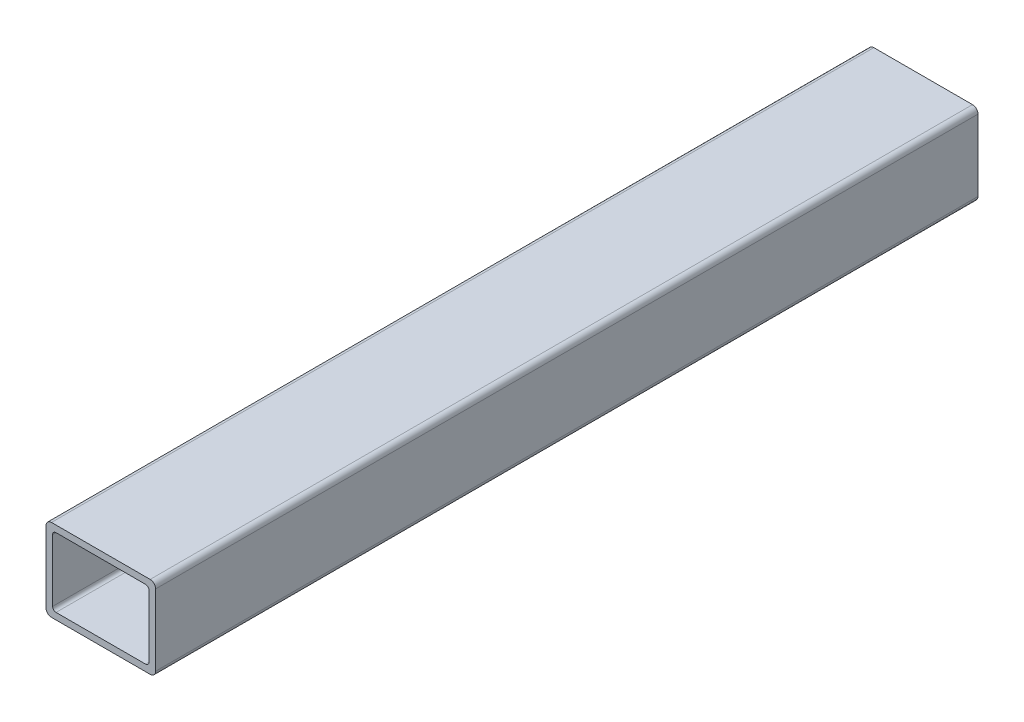
ISO-10303-21;
HEADER;
FILE_DESCRIPTION(('STEP AP214'),'2;1');
FILE_NAME('part.step','',(''),(''),'','','');
FILE_SCHEMA(('AUTOMOTIVE_DESIGN { 1 0 10303 214 1 1 1 1 }'));
ENDSEC;
DATA;
#1=APPLICATION_CONTEXT('core data for automotive mechanical design processes');
#2=APPLICATION_PROTOCOL_DEFINITION('international standard','automotive_design',2000,#1);
#3=PRODUCT_CONTEXT('',#1,'mechanical');
#4=PRODUCT('Part','Part','',(#3));
#5=PRODUCT_RELATED_PRODUCT_CATEGORY('part','',(#4));
#6=PRODUCT_DEFINITION_FORMATION('','',#4);
#7=PRODUCT_DEFINITION_CONTEXT('part definition',#1,'design');
#8=PRODUCT_DEFINITION('design','',#6,#7);
#9=PRODUCT_DEFINITION_SHAPE('','',#8);
#10=(LENGTH_UNIT() NAMED_UNIT(*) SI_UNIT(.MILLI.,.METRE.));
#11=(NAMED_UNIT(*) PLANE_ANGLE_UNIT() SI_UNIT($,.RADIAN.));
#12=(NAMED_UNIT(*) SI_UNIT($,.STERADIAN.) SOLID_ANGLE_UNIT());
#13=UNCERTAINTY_MEASURE_WITH_UNIT(LENGTH_MEASURE(1.E-05),#10,'distance_accuracy_value','');
#14=(GEOMETRIC_REPRESENTATION_CONTEXT(3) GLOBAL_UNCERTAINTY_ASSIGNED_CONTEXT((#13)) GLOBAL_UNIT_ASSIGNED_CONTEXT((#10,
#11,#12)) REPRESENTATION_CONTEXT('',''));
#15=CARTESIAN_POINT('',(0.,0.,0.));
#16=DIRECTION('',(0.,0.,1.));
#17=DIRECTION('',(1.,0.,0.));
#18=AXIS2_PLACEMENT_3D('',#15,#16,#17);
#19=CARTESIAN_POINT('',(22.86,-16.51,381.));
#20=DIRECTION('',(0.,0.,1.));
#21=DIRECTION('',(1.,0.,0.));
#22=AXIS2_PLACEMENT_3D('',#19,#20,#21);
#23=PLANE('',#22);
#24=CARTESIAN_POINT('',(22.86,-16.51,381.));
#25=DIRECTION('',(0.,0.,1.));
#26=DIRECTION('',(1.,0.,0.));
#27=AXIS2_PLACEMENT_3D('',#24,#25,#26);
#28=CIRCLE('',#27,2.53999999999999);
#29=CARTESIAN_POINT('',(22.86,-19.05,381.));
#30=VERTEX_POINT('',#29);
#31=CARTESIAN_POINT('',(25.4,-16.51,381.));
#32=VERTEX_POINT('',#31);
#33=EDGE_CURVE('E214',#30,#32,#28,.T.);
#34=ORIENTED_EDGE('',*,*,#33,.T.);
#35=DIRECTION('',(0.,1.,0.));
#36=VECTOR('',#35,1.);
#37=CARTESIAN_POINT('',(25.4,-16.51,381.));
#38=LINE('',#37,#36);
#39=CARTESIAN_POINT('',(25.4,16.51,381.));
#40=VERTEX_POINT('',#39);
#41=EDGE_CURVE('E217',#32,#40,#38,.T.);
#42=ORIENTED_EDGE('',*,*,#41,.T.);
#43=CARTESIAN_POINT('',(22.86,16.51,381.));
#44=DIRECTION('',(0.,0.,1.));
#45=DIRECTION('',(1.,0.,0.));
#46=AXIS2_PLACEMENT_3D('',#43,#44,#45);
#47=CIRCLE('',#46,2.54);
#48=CARTESIAN_POINT('',(22.86,19.05,381.));
#49=VERTEX_POINT('',#48);
#50=EDGE_CURVE('E220',#40,#49,#47,.T.);
#51=ORIENTED_EDGE('',*,*,#50,.T.);
#52=DIRECTION('',(-1.,0.,0.));
#53=VECTOR('',#52,1.);
#54=CARTESIAN_POINT('',(22.86,19.05,381.));
#55=LINE('',#54,#53);
#56=CARTESIAN_POINT('',(-22.86,19.05,381.));
#57=VERTEX_POINT('',#56);
#58=EDGE_CURVE('E222',#49,#57,#55,.T.);
#59=ORIENTED_EDGE('',*,*,#58,.T.);
#60=CARTESIAN_POINT('',(-22.86,16.51,381.));
#61=DIRECTION('',(0.,0.,1.));
#62=DIRECTION('',(1.,0.,0.));
#63=AXIS2_PLACEMENT_3D('',#60,#61,#62);
#64=CIRCLE('',#63,2.54);
#65=CARTESIAN_POINT('',(-25.4,16.51,381.));
#66=VERTEX_POINT('',#65);
#67=EDGE_CURVE('E224',#57,#66,#64,.T.);
#68=ORIENTED_EDGE('',*,*,#67,.T.);
#69=DIRECTION('',(0.,-1.,0.));
#70=VECTOR('',#69,1.);
#71=CARTESIAN_POINT('',(-25.4,-16.51,381.));
#72=LINE('',#71,#70);
#73=CARTESIAN_POINT('',(-25.4,-16.51,381.));
#74=VERTEX_POINT('',#73);
#75=EDGE_CURVE('E226',#66,#74,#72,.T.);
#76=ORIENTED_EDGE('',*,*,#75,.T.);
#77=CARTESIAN_POINT('',(-22.86,-16.51,381.));
#78=DIRECTION('',(0.,0.,1.));
#79=DIRECTION('',(1.,0.,0.));
#80=AXIS2_PLACEMENT_3D('',#77,#78,#79);
#81=CIRCLE('',#80,2.54);
#82=CARTESIAN_POINT('',(-22.86,-19.05,381.));
#83=VERTEX_POINT('',#82);
#84=EDGE_CURVE('E228',#74,#83,#81,.T.);
#85=ORIENTED_EDGE('',*,*,#84,.T.);
#86=DIRECTION('',(1.,0.,0.));
#87=VECTOR('',#86,1.);
#88=CARTESIAN_POINT('',(22.86,-19.05,381.));
#89=LINE('',#88,#87);
#90=EDGE_CURVE('E230',#83,#30,#89,.T.);
#91=ORIENTED_EDGE('',*,*,#90,.T.);
#92=EDGE_LOOP('',(#34,#42,#51,#59,#68,#76,#85,#91));
#93=FACE_BOUND('',#92,.T.);
#94=DIRECTION('',(-1.,0.,0.));
#95=VECTOR('',#94,1.);
#96=CARTESIAN_POINT('',(20.7518,16.002,381.));
#97=LINE('',#96,#95);
#98=CARTESIAN_POINT('',(20.7518,16.002,381.));
#99=VERTEX_POINT('',#98);
#100=CARTESIAN_POINT('',(-20.7518,16.002,381.));
#101=VERTEX_POINT('',#100);
#102=EDGE_CURVE('E157',#99,#101,#97,.T.);
#103=ORIENTED_EDGE('',*,*,#102,.F.);
#104=CARTESIAN_POINT('',(20.7518,14.4018,381.));
#105=DIRECTION('',(0.,0.,1.));
#106=DIRECTION('',(1.,0.,0.));
#107=AXIS2_PLACEMENT_3D('',#104,#105,#106);
#108=CIRCLE('',#107,1.6002);
#109=CARTESIAN_POINT('',(22.352,14.4018,381.));
#110=VERTEX_POINT('',#109);
#111=EDGE_CURVE('E149',#110,#99,#108,.T.);
#112=ORIENTED_EDGE('',*,*,#111,.F.);
#113=DIRECTION('',(0.,1.,0.));
#114=VECTOR('',#113,1.);
#115=CARTESIAN_POINT('',(22.352,14.4018,381.));
#116=LINE('',#115,#114);
#117=CARTESIAN_POINT('',(22.352,-14.4018,381.));
#118=VERTEX_POINT('',#117);
#119=EDGE_CURVE('E182',#118,#110,#116,.T.);
#120=ORIENTED_EDGE('',*,*,#119,.F.);
#121=CARTESIAN_POINT('',(20.7518,-14.4018,381.));
#122=DIRECTION('',(0.,0.,1.));
#123=DIRECTION('',(1.,0.,0.));
#124=AXIS2_PLACEMENT_3D('',#121,#122,#123);
#125=CIRCLE('',#124,1.6002);
#126=CARTESIAN_POINT('',(20.7518,-16.002,381.));
#127=VERTEX_POINT('',#126);
#128=EDGE_CURVE('E180',#127,#118,#125,.T.);
#129=ORIENTED_EDGE('',*,*,#128,.F.);
#130=DIRECTION('',(1.,0.,0.));
#131=VECTOR('',#130,1.);
#132=CARTESIAN_POINT('',(20.7518,-16.002,381.));
#133=LINE('',#132,#131);
#134=CARTESIAN_POINT('',(-20.7518,-16.002,381.));
#135=VERTEX_POINT('',#134);
#136=EDGE_CURVE('E178',#135,#127,#133,.T.);
#137=ORIENTED_EDGE('',*,*,#136,.F.);
#138=CARTESIAN_POINT('',(-20.7518,-14.4018,381.));
#139=DIRECTION('',(0.,0.,1.));
#140=DIRECTION('',(1.,0.,0.));
#141=AXIS2_PLACEMENT_3D('',#138,#139,#140);
#142=CIRCLE('',#141,1.6002);
#143=CARTESIAN_POINT('',(-22.352,-14.4018,381.));
#144=VERTEX_POINT('',#143);
#145=EDGE_CURVE('E176',#144,#135,#142,.T.);
#146=ORIENTED_EDGE('',*,*,#145,.F.);
#147=DIRECTION('',(0.,-1.,0.));
#148=VECTOR('',#147,1.);
#149=CARTESIAN_POINT('',(-22.352,14.4018,381.));
#150=LINE('',#149,#148);
#151=CARTESIAN_POINT('',(-22.352,14.4018,381.));
#152=VERTEX_POINT('',#151);
#153=EDGE_CURVE('E172',#152,#144,#150,.T.);
#154=ORIENTED_EDGE('',*,*,#153,.F.);
#155=CARTESIAN_POINT('',(-20.7518,14.4018,381.));
#156=DIRECTION('',(0.,0.,1.));
#157=DIRECTION('',(1.,0.,0.));
#158=AXIS2_PLACEMENT_3D('',#155,#156,#157);
#159=CIRCLE('',#158,1.6002);
#160=EDGE_CURVE('E170',#101,#152,#159,.T.);
#161=ORIENTED_EDGE('',*,*,#160,.F.);
#162=EDGE_LOOP('',(#103,#112,#120,#129,#137,#146,#154,#161));
#163=FACE_BOUND('',#162,.T.);
#164=ADVANCED_FACE('F36',(#93,#163),#23,.T.);
#165=CARTESIAN_POINT('',(22.86,-16.51,0.));
#166=DIRECTION('',(0.,0.,1.));
#167=DIRECTION('',(1.,0.,0.));
#168=AXIS2_PLACEMENT_3D('',#165,#166,#167);
#169=PLANE('',#168);
#170=CARTESIAN_POINT('',(22.86,-16.51,0.));
#171=DIRECTION('',(0.,0.,1.));
#172=DIRECTION('',(1.,0.,0.));
#173=AXIS2_PLACEMENT_3D('',#170,#171,#172);
#174=CIRCLE('',#173,2.53999999999999);
#175=CARTESIAN_POINT('',(22.86,-19.05,0.));
#176=VERTEX_POINT('',#175);
#177=CARTESIAN_POINT('',(25.4,-16.51,0.));
#178=VERTEX_POINT('',#177);
#179=EDGE_CURVE('E165',#176,#178,#174,.T.);
#180=ORIENTED_EDGE('',*,*,#179,.F.);
#181=DIRECTION('',(1.,0.,0.));
#182=VECTOR('',#181,1.);
#183=CARTESIAN_POINT('',(22.86,-19.05,0.));
#184=LINE('',#183,#182);
#185=CARTESIAN_POINT('',(-22.86,-19.05,0.));
#186=VERTEX_POINT('',#185);
#187=EDGE_CURVE('E218',#186,#176,#184,.T.);
#188=ORIENTED_EDGE('',*,*,#187,.F.);
#189=CARTESIAN_POINT('',(-22.86,-16.51,0.));
#190=DIRECTION('',(0.,0.,1.));
#191=DIRECTION('',(1.,0.,0.));
#192=AXIS2_PLACEMENT_3D('',#189,#190,#191);
#193=CIRCLE('',#192,2.54);
#194=CARTESIAN_POINT('',(-25.4,-16.51,0.));
#195=VERTEX_POINT('',#194);
#196=EDGE_CURVE('E245',#195,#186,#193,.T.);
#197=ORIENTED_EDGE('',*,*,#196,.F.);
#198=DIRECTION('',(0.,-1.,0.));
#199=VECTOR('',#198,1.);
#200=CARTESIAN_POINT('',(-25.4,-16.51,0.));
#201=LINE('',#200,#199);
#202=CARTESIAN_POINT('',(-25.4,16.51,0.));
#203=VERTEX_POINT('',#202);
#204=EDGE_CURVE('E243',#203,#195,#201,.T.);
#205=ORIENTED_EDGE('',*,*,#204,.F.);
#206=CARTESIAN_POINT('',(-22.86,16.51,0.));
#207=DIRECTION('',(0.,0.,1.));
#208=DIRECTION('',(1.,0.,0.));
#209=AXIS2_PLACEMENT_3D('',#206,#207,#208);
#210=CIRCLE('',#209,2.54);
#211=CARTESIAN_POINT('',(-22.86,19.05,0.));
#212=VERTEX_POINT('',#211);
#213=EDGE_CURVE('E241',#212,#203,#210,.T.);
#214=ORIENTED_EDGE('',*,*,#213,.F.);
#215=DIRECTION('',(-1.,0.,0.));
#216=VECTOR('',#215,1.);
#217=CARTESIAN_POINT('',(22.86,19.05,0.));
#218=LINE('',#217,#216);
#219=CARTESIAN_POINT('',(22.86,19.05,0.));
#220=VERTEX_POINT('',#219);
#221=EDGE_CURVE('E239',#220,#212,#218,.T.);
#222=ORIENTED_EDGE('',*,*,#221,.F.);
#223=CARTESIAN_POINT('',(22.86,16.51,0.));
#224=DIRECTION('',(0.,0.,1.));
#225=DIRECTION('',(1.,0.,0.));
#226=AXIS2_PLACEMENT_3D('',#223,#224,#225);
#227=CIRCLE('',#226,2.54);
#228=CARTESIAN_POINT('',(25.4,16.51,0.));
#229=VERTEX_POINT('',#228);
#230=EDGE_CURVE('E237',#229,#220,#227,.T.);
#231=ORIENTED_EDGE('',*,*,#230,.F.);
#232=DIRECTION('',(0.,1.,0.));
#233=VECTOR('',#232,1.);
#234=CARTESIAN_POINT('',(25.4,-16.51,0.));
#235=LINE('',#234,#233);
#236=EDGE_CURVE('E235',#178,#229,#235,.T.);
#237=ORIENTED_EDGE('',*,*,#236,.F.);
#238=EDGE_LOOP('',(#180,#188,#197,#205,#214,#222,#231,#237));
#239=FACE_BOUND('',#238,.T.);
#240=CARTESIAN_POINT('',(20.7518,14.4018,0.));
#241=DIRECTION('',(0.,0.,1.));
#242=DIRECTION('',(1.,0.,0.));
#243=AXIS2_PLACEMENT_3D('',#240,#241,#242);
#244=CIRCLE('',#243,1.6002);
#245=CARTESIAN_POINT('',(22.352,14.4018,0.));
#246=VERTEX_POINT('',#245);
#247=CARTESIAN_POINT('',(20.7518,16.002,0.));
#248=VERTEX_POINT('',#247);
#249=EDGE_CURVE('E59',#246,#248,#244,.T.);
#250=ORIENTED_EDGE('',*,*,#249,.T.);
#251=DIRECTION('',(-1.,0.,0.));
#252=VECTOR('',#251,1.);
#253=CARTESIAN_POINT('',(20.7518,16.002,0.));
#254=LINE('',#253,#252);
#255=CARTESIAN_POINT('',(-20.7518,16.002,0.));
#256=VERTEX_POINT('',#255);
#257=EDGE_CURVE('E164',#248,#256,#254,.T.);
#258=ORIENTED_EDGE('',*,*,#257,.T.);
#259=CARTESIAN_POINT('',(-20.7518,14.4018,0.));
#260=DIRECTION('',(0.,0.,1.));
#261=DIRECTION('',(1.,0.,0.));
#262=AXIS2_PLACEMENT_3D('',#259,#260,#261);
#263=CIRCLE('',#262,1.6002);
#264=CARTESIAN_POINT('',(-22.352,14.4018,0.));
#265=VERTEX_POINT('',#264);
#266=EDGE_CURVE('E186',#256,#265,#263,.T.);
#267=ORIENTED_EDGE('',*,*,#266,.T.);
#268=DIRECTION('',(0.,-1.,0.));
#269=VECTOR('',#268,1.);
#270=CARTESIAN_POINT('',(-22.352,14.4018,0.));
#271=LINE('',#270,#269);
#272=CARTESIAN_POINT('',(-22.352,-14.4018,0.));
#273=VERTEX_POINT('',#272);
#274=EDGE_CURVE('E189',#265,#273,#271,.T.);
#275=ORIENTED_EDGE('',*,*,#274,.T.);
#276=CARTESIAN_POINT('',(-20.7518,-14.4018,0.));
#277=DIRECTION('',(0.,0.,1.));
#278=DIRECTION('',(1.,0.,0.));
#279=AXIS2_PLACEMENT_3D('',#276,#277,#278);
#280=CIRCLE('',#279,1.6002);
#281=CARTESIAN_POINT('',(-20.7518,-16.002,0.));
#282=VERTEX_POINT('',#281);
#283=EDGE_CURVE('E192',#273,#282,#280,.T.);
#284=ORIENTED_EDGE('',*,*,#283,.T.);
#285=DIRECTION('',(1.,0.,0.));
#286=VECTOR('',#285,1.);
#287=CARTESIAN_POINT('',(20.7518,-16.002,0.));
#288=LINE('',#287,#286);
#289=CARTESIAN_POINT('',(20.7518,-16.002,0.));
#290=VERTEX_POINT('',#289);
#291=EDGE_CURVE('E195',#282,#290,#288,.T.);
#292=ORIENTED_EDGE('',*,*,#291,.T.);
#293=CARTESIAN_POINT('',(20.7518,-14.4018,0.));
#294=DIRECTION('',(0.,0.,1.));
#295=DIRECTION('',(1.,0.,0.));
#296=AXIS2_PLACEMENT_3D('',#293,#294,#295);
#297=CIRCLE('',#296,1.6002);
#298=CARTESIAN_POINT('',(22.352,-14.4018,0.));
#299=VERTEX_POINT('',#298);
#300=EDGE_CURVE('E198',#290,#299,#297,.T.);
#301=ORIENTED_EDGE('',*,*,#300,.T.);
#302=DIRECTION('',(0.,1.,0.));
#303=VECTOR('',#302,1.);
#304=CARTESIAN_POINT('',(22.352,14.4018,0.));
#305=LINE('',#304,#303);
#306=EDGE_CURVE('E158',#299,#246,#305,.T.);
#307=ORIENTED_EDGE('',*,*,#306,.T.);
#308=EDGE_LOOP('',(#250,#258,#267,#275,#284,#292,#301,#307));
#309=FACE_BOUND('',#308,.T.);
#310=ADVANCED_FACE('F275',(#239,#309),#169,.F.);
#311=CARTESIAN_POINT('',(22.86,-16.51,381.));
#312=DIRECTION('',(0.,0.,-1.));
#313=DIRECTION('',(-1.,0.,0.));
#314=AXIS2_PLACEMENT_3D('',#311,#312,#313);
#315=CYLINDRICAL_SURFACE('',#314,2.53999999999999);
#316=ORIENTED_EDGE('',*,*,#179,.T.);
#317=DIRECTION('',(0.,0.,-1.));
#318=VECTOR('',#317,1.);
#319=CARTESIAN_POINT('',(25.4,-16.51,381.));
#320=LINE('',#319,#318);
#321=EDGE_CURVE('E11',#32,#178,#320,.T.);
#322=ORIENTED_EDGE('',*,*,#321,.F.);
#323=ORIENTED_EDGE('',*,*,#33,.F.);
#324=DIRECTION('',(0.,0.,-1.));
#325=VECTOR('',#324,1.);
#326=CARTESIAN_POINT('',(22.86,-19.05,381.));
#327=LINE('',#326,#325);
#328=EDGE_CURVE('E232',#30,#176,#327,.T.);
#329=ORIENTED_EDGE('',*,*,#328,.T.);
#330=EDGE_LOOP('',(#316,#322,#323,#329));
#331=FACE_BOUND('',#330,.T.);
#332=ADVANCED_FACE('F38',(#331),#315,.T.);
#333=CARTESIAN_POINT('',(25.4,-16.51,381.));
#334=DIRECTION('',(-1.,0.,0.));
#335=DIRECTION('',(0.,0.,1.));
#336=AXIS2_PLACEMENT_3D('',#333,#334,#335);
#337=PLANE('',#336);
#338=ORIENTED_EDGE('',*,*,#236,.T.);
#339=DIRECTION('',(0.,0.,-1.));
#340=VECTOR('',#339,1.);
#341=CARTESIAN_POINT('',(25.4,16.51,381.));
#342=LINE('',#341,#340);
#343=EDGE_CURVE('E44',#40,#229,#342,.T.);
#344=ORIENTED_EDGE('',*,*,#343,.F.);
#345=ORIENTED_EDGE('',*,*,#41,.F.);
#346=ORIENTED_EDGE('',*,*,#321,.T.);
#347=EDGE_LOOP('',(#338,#344,#345,#346));
#348=FACE_BOUND('',#347,.T.);
#349=ADVANCED_FACE('F292',(#348),#337,.F.);
#350=CARTESIAN_POINT('',(22.86,16.51,381.));
#351=DIRECTION('',(0.,0.,-1.));
#352=DIRECTION('',(-1.,0.,0.));
#353=AXIS2_PLACEMENT_3D('',#350,#351,#352);
#354=CYLINDRICAL_SURFACE('',#353,2.54);
#355=ORIENTED_EDGE('',*,*,#230,.T.);
#356=DIRECTION('',(0.,0.,-1.));
#357=VECTOR('',#356,1.);
#358=CARTESIAN_POINT('',(22.86,19.05,381.));
#359=LINE('',#358,#357);
#360=EDGE_CURVE('E262',#49,#220,#359,.T.);
#361=ORIENTED_EDGE('',*,*,#360,.F.);
#362=ORIENTED_EDGE('',*,*,#50,.F.);
#363=ORIENTED_EDGE('',*,*,#343,.T.);
#364=EDGE_LOOP('',(#355,#361,#362,#363));
#365=FACE_BOUND('',#364,.T.);
#366=ADVANCED_FACE('F269',(#365),#354,.T.);
#367=CARTESIAN_POINT('',(22.86,19.05,381.));
#368=DIRECTION('',(0.,-1.,0.));
#369=DIRECTION('',(0.,0.,-1.));
#370=AXIS2_PLACEMENT_3D('',#367,#368,#369);
#371=PLANE('',#370);
#372=ORIENTED_EDGE('',*,*,#221,.T.);
#373=DIRECTION('',(0.,0.,-1.));
#374=VECTOR('',#373,1.);
#375=CARTESIAN_POINT('',(-22.86,19.05,381.));
#376=LINE('',#375,#374);
#377=EDGE_CURVE('E259',#57,#212,#376,.T.);
#378=ORIENTED_EDGE('',*,*,#377,.F.);
#379=ORIENTED_EDGE('',*,*,#58,.F.);
#380=ORIENTED_EDGE('',*,*,#360,.T.);
#381=EDGE_LOOP('',(#372,#378,#379,#380));
#382=FACE_BOUND('',#381,.T.);
#383=ADVANCED_FACE('F281',(#382),#371,.F.);
#384=CARTESIAN_POINT('',(-22.86,16.51,381.));
#385=DIRECTION('',(0.,0.,-1.));
#386=DIRECTION('',(-1.,0.,0.));
#387=AXIS2_PLACEMENT_3D('',#384,#385,#386);
#388=CYLINDRICAL_SURFACE('',#387,2.54);
#389=ORIENTED_EDGE('',*,*,#213,.T.);
#390=DIRECTION('',(0.,0.,-1.));
#391=VECTOR('',#390,1.);
#392=CARTESIAN_POINT('',(-25.4,16.51,381.));
#393=LINE('',#392,#391);
#394=EDGE_CURVE('E256',#66,#203,#393,.T.);
#395=ORIENTED_EDGE('',*,*,#394,.F.);
#396=ORIENTED_EDGE('',*,*,#67,.F.);
#397=ORIENTED_EDGE('',*,*,#377,.T.);
#398=EDGE_LOOP('',(#389,#395,#396,#397));
#399=FACE_BOUND('',#398,.T.);
#400=ADVANCED_FACE('F285',(#399),#388,.T.);
#401=CARTESIAN_POINT('',(-25.4,-16.51,381.));
#402=DIRECTION('',(1.,0.,0.));
#403=DIRECTION('',(0.,1.,0.));
#404=AXIS2_PLACEMENT_3D('',#401,#402,#403);
#405=PLANE('',#404);
#406=ORIENTED_EDGE('',*,*,#204,.T.);
#407=DIRECTION('',(0.,0.,-1.));
#408=VECTOR('',#407,1.);
#409=CARTESIAN_POINT('',(-25.4,-16.51,381.));
#410=LINE('',#409,#408);
#411=EDGE_CURVE('E253',#74,#195,#410,.T.);
#412=ORIENTED_EDGE('',*,*,#411,.F.);
#413=ORIENTED_EDGE('',*,*,#75,.F.);
#414=ORIENTED_EDGE('',*,*,#394,.T.);
#415=EDGE_LOOP('',(#406,#412,#413,#414));
#416=FACE_BOUND('',#415,.T.);
#417=ADVANCED_FACE('F305',(#416),#405,.F.);
#418=CARTESIAN_POINT('',(-22.86,-16.51,381.));
#419=DIRECTION('',(0.,0.,-1.));
#420=DIRECTION('',(-1.,0.,0.));
#421=AXIS2_PLACEMENT_3D('',#418,#419,#420);
#422=CYLINDRICAL_SURFACE('',#421,2.54);
#423=ORIENTED_EDGE('',*,*,#196,.T.);
#424=DIRECTION('',(0.,0.,-1.));
#425=VECTOR('',#424,1.);
#426=CARTESIAN_POINT('',(-22.86,-19.05,381.));
#427=LINE('',#426,#425);
#428=EDGE_CURVE('E250',#83,#186,#427,.T.);
#429=ORIENTED_EDGE('',*,*,#428,.F.);
#430=ORIENTED_EDGE('',*,*,#84,.F.);
#431=ORIENTED_EDGE('',*,*,#411,.T.);
#432=EDGE_LOOP('',(#423,#429,#430,#431));
#433=FACE_BOUND('',#432,.T.);
#434=ADVANCED_FACE('F303',(#433),#422,.T.);
#435=CARTESIAN_POINT('',(22.86,-19.05,381.));
#436=DIRECTION('',(0.,1.,0.));
#437=DIRECTION('',(-1.,0.,0.));
#438=AXIS2_PLACEMENT_3D('',#435,#436,#437);
#439=PLANE('',#438);
#440=ORIENTED_EDGE('',*,*,#187,.T.);
#441=ORIENTED_EDGE('',*,*,#328,.F.);
#442=ORIENTED_EDGE('',*,*,#90,.F.);
#443=ORIENTED_EDGE('',*,*,#428,.T.);
#444=EDGE_LOOP('',(#440,#441,#442,#443));
#445=FACE_BOUND('',#444,.T.);
#446=ADVANCED_FACE('F298',(#445),#439,.F.);
#447=CARTESIAN_POINT('',(20.7518,14.4018,381.));
#448=DIRECTION('',(0.,0.,-1.));
#449=DIRECTION('',(-1.,0.,0.));
#450=AXIS2_PLACEMENT_3D('',#447,#448,#449);
#451=CYLINDRICAL_SURFACE('',#450,1.6002);
#452=ORIENTED_EDGE('',*,*,#249,.F.);
#453=DIRECTION('',(0.,0.,-1.));
#454=VECTOR('',#453,1.);
#455=CARTESIAN_POINT('',(22.352,14.4018,381.));
#456=LINE('',#455,#454);
#457=EDGE_CURVE('E153',#110,#246,#456,.T.);
#458=ORIENTED_EDGE('',*,*,#457,.F.);
#459=ORIENTED_EDGE('',*,*,#111,.T.);
#460=DIRECTION('',(0.,0.,-1.));
#461=VECTOR('',#460,1.);
#462=CARTESIAN_POINT('',(20.7518,16.002,381.));
#463=LINE('',#462,#461);
#464=EDGE_CURVE('E152',#99,#248,#463,.T.);
#465=ORIENTED_EDGE('',*,*,#464,.T.);
#466=EDGE_LOOP('',(#452,#458,#459,#465));
#467=FACE_BOUND('',#466,.T.);
#468=ADVANCED_FACE('F151',(#467),#451,.F.);
#469=CARTESIAN_POINT('',(20.7518,16.002,381.));
#470=DIRECTION('',(0.,-1.,0.));
#471=DIRECTION('',(1.,0.,0.));
#472=AXIS2_PLACEMENT_3D('',#469,#470,#471);
#473=PLANE('',#472);
#474=ORIENTED_EDGE('',*,*,#257,.F.);
#475=ORIENTED_EDGE('',*,*,#464,.F.);
#476=ORIENTED_EDGE('',*,*,#102,.T.);
#477=DIRECTION('',(0.,0.,-1.));
#478=VECTOR('',#477,1.);
#479=CARTESIAN_POINT('',(-20.7518,16.002,381.));
#480=LINE('',#479,#478);
#481=EDGE_CURVE('E166',#101,#256,#480,.T.);
#482=ORIENTED_EDGE('',*,*,#481,.T.);
#483=EDGE_LOOP('',(#474,#475,#476,#482));
#484=FACE_BOUND('',#483,.T.);
#485=ADVANCED_FACE('F161',(#484),#473,.T.);
#486=CARTESIAN_POINT('',(-20.7518,14.4018,381.));
#487=DIRECTION('',(0.,0.,-1.));
#488=DIRECTION('',(-1.,0.,0.));
#489=AXIS2_PLACEMENT_3D('',#486,#487,#488);
#490=CYLINDRICAL_SURFACE('',#489,1.6002);
#491=ORIENTED_EDGE('',*,*,#266,.F.);
#492=ORIENTED_EDGE('',*,*,#481,.F.);
#493=ORIENTED_EDGE('',*,*,#160,.T.);
#494=DIRECTION('',(0.,0.,-1.));
#495=VECTOR('',#494,1.);
#496=CARTESIAN_POINT('',(-22.352,14.4018,381.));
#497=LINE('',#496,#495);
#498=EDGE_CURVE('E211',#152,#265,#497,.T.);
#499=ORIENTED_EDGE('',*,*,#498,.T.);
#500=EDGE_LOOP('',(#491,#492,#493,#499));
#501=FACE_BOUND('',#500,.T.);
#502=ADVANCED_FACE('F330',(#501),#490,.F.);
#503=CARTESIAN_POINT('',(-22.352,14.4018,381.));
#504=DIRECTION('',(1.,0.,0.));
#505=DIRECTION('',(0.,1.,0.));
#506=AXIS2_PLACEMENT_3D('',#503,#504,#505);
#507=PLANE('',#506);
#508=ORIENTED_EDGE('',*,*,#274,.F.);
#509=ORIENTED_EDGE('',*,*,#498,.F.);
#510=ORIENTED_EDGE('',*,*,#153,.T.);
#511=DIRECTION('',(0.,0.,-1.));
#512=VECTOR('',#511,1.);
#513=CARTESIAN_POINT('',(-22.352,-14.4018,381.));
#514=LINE('',#513,#512);
#515=EDGE_CURVE('E209',#144,#273,#514,.T.);
#516=ORIENTED_EDGE('',*,*,#515,.T.);
#517=EDGE_LOOP('',(#508,#509,#510,#516));
#518=FACE_BOUND('',#517,.T.);
#519=ADVANCED_FACE('F334',(#518),#507,.T.);
#520=CARTESIAN_POINT('',(-20.7518,-14.4018,381.));
#521=DIRECTION('',(0.,0.,-1.));
#522=DIRECTION('',(-1.,0.,0.));
#523=AXIS2_PLACEMENT_3D('',#520,#521,#522);
#524=CYLINDRICAL_SURFACE('',#523,1.6002);
#525=ORIENTED_EDGE('',*,*,#283,.F.);
#526=ORIENTED_EDGE('',*,*,#515,.F.);
#527=ORIENTED_EDGE('',*,*,#145,.T.);
#528=DIRECTION('',(0.,0.,-1.));
#529=VECTOR('',#528,1.);
#530=CARTESIAN_POINT('',(-20.7518,-16.002,381.));
#531=LINE('',#530,#529);
#532=EDGE_CURVE('E207',#135,#282,#531,.T.);
#533=ORIENTED_EDGE('',*,*,#532,.T.);
#534=EDGE_LOOP('',(#525,#526,#527,#533));
#535=FACE_BOUND('',#534,.T.);
#536=ADVANCED_FACE('F340',(#535),#524,.F.);
#537=CARTESIAN_POINT('',(20.7518,-16.002,381.));
#538=DIRECTION('',(0.,1.,0.));
#539=DIRECTION('',(-1.,0.,0.));
#540=AXIS2_PLACEMENT_3D('',#537,#538,#539);
#541=PLANE('',#540);
#542=ORIENTED_EDGE('',*,*,#291,.F.);
#543=ORIENTED_EDGE('',*,*,#532,.F.);
#544=ORIENTED_EDGE('',*,*,#136,.T.);
#545=DIRECTION('',(0.,0.,-1.));
#546=VECTOR('',#545,1.);
#547=CARTESIAN_POINT('',(20.7518,-16.002,381.));
#548=LINE('',#547,#546);
#549=EDGE_CURVE('E205',#127,#290,#548,.T.);
#550=ORIENTED_EDGE('',*,*,#549,.T.);
#551=EDGE_LOOP('',(#542,#543,#544,#550));
#552=FACE_BOUND('',#551,.T.);
#553=ADVANCED_FACE('F344',(#552),#541,.T.);
#554=CARTESIAN_POINT('',(20.7518,-14.4018,381.));
#555=DIRECTION('',(0.,0.,-1.));
#556=DIRECTION('',(-1.,0.,0.));
#557=AXIS2_PLACEMENT_3D('',#554,#555,#556);
#558=CYLINDRICAL_SURFACE('',#557,1.6002);
#559=ORIENTED_EDGE('',*,*,#300,.F.);
#560=ORIENTED_EDGE('',*,*,#549,.F.);
#561=ORIENTED_EDGE('',*,*,#128,.T.);
#562=DIRECTION('',(0.,0.,-1.));
#563=VECTOR('',#562,1.);
#564=CARTESIAN_POINT('',(22.352,-14.4018,381.));
#565=LINE('',#564,#563);
#566=EDGE_CURVE('E51',#118,#299,#565,.T.);
#567=ORIENTED_EDGE('',*,*,#566,.T.);
#568=EDGE_LOOP('',(#559,#560,#561,#567));
#569=FACE_BOUND('',#568,.T.);
#570=ADVANCED_FACE('F348',(#569),#558,.F.);
#571=CARTESIAN_POINT('',(22.352,14.4018,381.));
#572=DIRECTION('',(-1.,0.,0.));
#573=DIRECTION('',(0.,-1.,0.));
#574=AXIS2_PLACEMENT_3D('',#571,#572,#573);
#575=PLANE('',#574);
#576=ORIENTED_EDGE('',*,*,#306,.F.);
#577=ORIENTED_EDGE('',*,*,#566,.F.);
#578=ORIENTED_EDGE('',*,*,#119,.T.);
#579=ORIENTED_EDGE('',*,*,#457,.T.);
#580=EDGE_LOOP('',(#576,#577,#578,#579));
#581=FACE_BOUND('',#580,.T.);
#582=ADVANCED_FACE('F352',(#581),#575,.T.);
#583=CLOSED_SHELL('',(#164,#310,#332,#349,#366,#383,#400,#417,#434,#446,#468,#485,#502,#519,
#536,#553,#570,#582));
#584=MANIFOLD_SOLID_BREP('B2',#583);
#585=ADVANCED_BREP_SHAPE_REPRESENTATION('',(#18,#584),#14);
#586=SHAPE_DEFINITION_REPRESENTATION(#9,#585);
ENDSEC;
END-ISO-10303-21;
